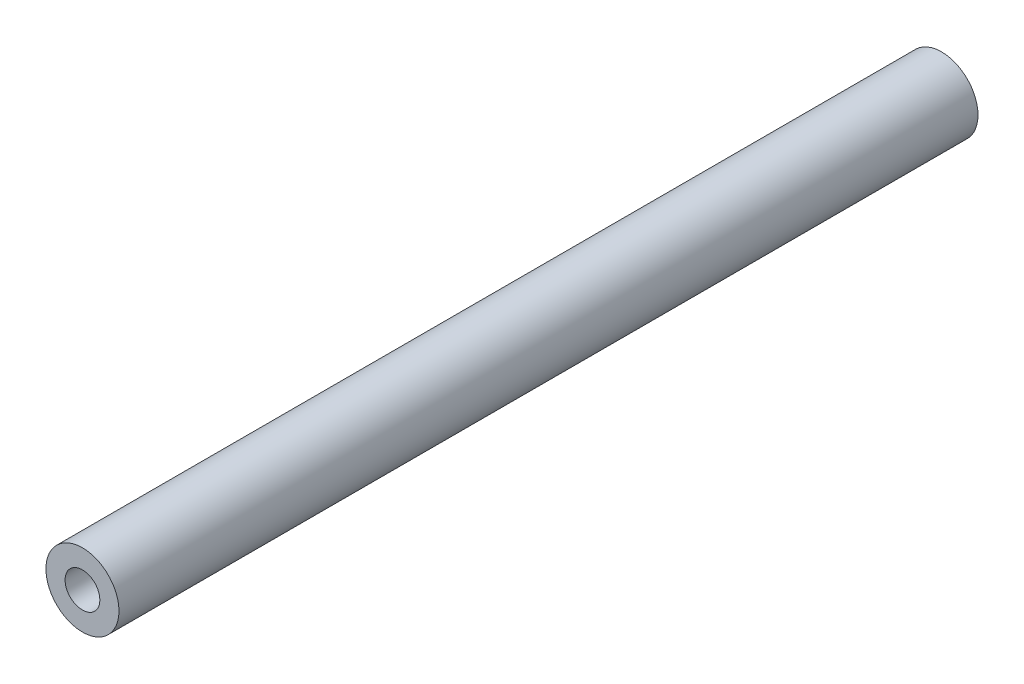
ISO-10303-21;
HEADER;
FILE_DESCRIPTION(('STEP AP214'),'2;1');
FILE_NAME('part.step','',(''),(''),'','','');
FILE_SCHEMA(('AUTOMOTIVE_DESIGN { 1 0 10303 214 1 1 1 1 }'));
ENDSEC;
DATA;
#1=APPLICATION_CONTEXT('core data for automotive mechanical design processes');
#2=APPLICATION_PROTOCOL_DEFINITION('international standard','automotive_design',2000,#1);
#3=PRODUCT_CONTEXT('',#1,'mechanical');
#4=PRODUCT('Part','Part','',(#3));
#5=PRODUCT_RELATED_PRODUCT_CATEGORY('part','',(#4));
#6=PRODUCT_DEFINITION_FORMATION('','',#4);
#7=PRODUCT_DEFINITION_CONTEXT('part definition',#1,'design');
#8=PRODUCT_DEFINITION('design','',#6,#7);
#9=PRODUCT_DEFINITION_SHAPE('','',#8);
#10=(LENGTH_UNIT() NAMED_UNIT(*) SI_UNIT(.MILLI.,.METRE.));
#11=(NAMED_UNIT(*) PLANE_ANGLE_UNIT() SI_UNIT($,.RADIAN.));
#12=(NAMED_UNIT(*) SI_UNIT($,.STERADIAN.) SOLID_ANGLE_UNIT());
#13=UNCERTAINTY_MEASURE_WITH_UNIT(LENGTH_MEASURE(1.E-05),#10,'distance_accuracy_value','');
#14=(GEOMETRIC_REPRESENTATION_CONTEXT(3) GLOBAL_UNCERTAINTY_ASSIGNED_CONTEXT((#13)) GLOBAL_UNIT_ASSIGNED_CONTEXT((#10,
#11,#12)) REPRESENTATION_CONTEXT('',''));
#15=CARTESIAN_POINT('',(0.,0.,0.));
#16=DIRECTION('',(0.,0.,1.));
#17=DIRECTION('',(1.,0.,0.));
#18=AXIS2_PLACEMENT_3D('',#15,#16,#17);
#19=CARTESIAN_POINT('',(0.,0.,49.4));
#20=DIRECTION('',(0.,0.,1.));
#21=DIRECTION('',(1.,0.,0.));
#22=AXIS2_PLACEMENT_3D('',#19,#20,#21);
#23=PLANE('',#22);
#24=CARTESIAN_POINT('',(0.,0.,49.4));
#25=DIRECTION('',(0.,0.,1.));
#26=DIRECTION('',(1.,0.,0.));
#27=AXIS2_PLACEMENT_3D('',#24,#25,#26);
#28=CIRCLE('',#27,2.1);
#29=CARTESIAN_POINT('',(2.1,0.,49.4));
#30=VERTEX_POINT('',#29);
#31=EDGE_CURVE('E10',#30,#30,#28,.T.);
#32=ORIENTED_EDGE('',*,*,#31,.T.);
#33=EDGE_LOOP('',(#32));
#34=FACE_BOUND('',#33,.T.);
#35=CARTESIAN_POINT('',(0.,0.,49.4));
#36=DIRECTION('',(0.,0.,1.));
#37=DIRECTION('',(1.,0.,0.));
#38=AXIS2_PLACEMENT_3D('',#35,#36,#37);
#39=CIRCLE('',#38,1.);
#40=CARTESIAN_POINT('',(1.,0.,49.4));
#41=VERTEX_POINT('',#40);
#42=EDGE_CURVE('E41',#41,#41,#39,.T.);
#43=ORIENTED_EDGE('',*,*,#42,.F.);
#44=EDGE_LOOP('',(#43));
#45=FACE_BOUND('',#44,.T.);
#46=ADVANCED_FACE('F30',(#34,#45),#23,.T.);
#47=CARTESIAN_POINT('',(0.,0.,0.));
#48=DIRECTION('',(0.,0.,1.));
#49=DIRECTION('',(1.,0.,0.));
#50=AXIS2_PLACEMENT_3D('',#47,#48,#49);
#51=PLANE('',#50);
#52=CARTESIAN_POINT('',(0.,0.,0.));
#53=DIRECTION('',(0.,0.,1.));
#54=DIRECTION('',(1.,0.,0.));
#55=AXIS2_PLACEMENT_3D('',#52,#53,#54);
#56=CIRCLE('',#55,2.1);
#57=CARTESIAN_POINT('',(2.1,0.,0.));
#58=VERTEX_POINT('',#57);
#59=EDGE_CURVE('E34',#58,#58,#56,.T.);
#60=ORIENTED_EDGE('',*,*,#59,.F.);
#61=EDGE_LOOP('',(#60));
#62=FACE_BOUND('',#61,.T.);
#63=CARTESIAN_POINT('',(0.,0.,0.));
#64=DIRECTION('',(0.,0.,1.));
#65=DIRECTION('',(1.,0.,0.));
#66=AXIS2_PLACEMENT_3D('',#63,#64,#65);
#67=CIRCLE('',#66,1.);
#68=CARTESIAN_POINT('',(1.,0.,0.));
#69=VERTEX_POINT('',#68);
#70=EDGE_CURVE('E43',#69,#69,#67,.T.);
#71=ORIENTED_EDGE('',*,*,#70,.T.);
#72=EDGE_LOOP('',(#71));
#73=FACE_BOUND('',#72,.T.);
#74=ADVANCED_FACE('F53',(#62,#73),#51,.F.);
#75=CARTESIAN_POINT('',(0.,0.,49.4));
#76=DIRECTION('',(0.,0.,-1.));
#77=DIRECTION('',(-1.,0.,0.));
#78=AXIS2_PLACEMENT_3D('',#75,#76,#77);
#79=CYLINDRICAL_SURFACE('',#78,2.1);
#80=ORIENTED_EDGE('',*,*,#31,.F.);
#81=EDGE_LOOP('',(#80));
#82=FACE_BOUND('',#81,.T.);
#83=ORIENTED_EDGE('',*,*,#59,.T.);
#84=EDGE_LOOP('',(#83));
#85=FACE_BOUND('',#84,.T.);
#86=ADVANCED_FACE('F32',(#82,#85),#79,.T.);
#87=CARTESIAN_POINT('',(0.,0.,49.4));
#88=DIRECTION('',(0.,0.,-1.));
#89=DIRECTION('',(-1.,0.,0.));
#90=AXIS2_PLACEMENT_3D('',#87,#88,#89);
#91=CYLINDRICAL_SURFACE('',#90,1.);
#92=ORIENTED_EDGE('',*,*,#42,.T.);
#93=EDGE_LOOP('',(#92));
#94=FACE_BOUND('',#93,.T.);
#95=ORIENTED_EDGE('',*,*,#70,.F.);
#96=EDGE_LOOP('',(#95));
#97=FACE_BOUND('',#96,.T.);
#98=ADVANCED_FACE('F49',(#94,#97),#91,.F.);
#99=CLOSED_SHELL('',(#46,#74,#86,#98));
#100=MANIFOLD_SOLID_BREP('B2',#99);
#101=ADVANCED_BREP_SHAPE_REPRESENTATION('',(#18,#100),#14);
#102=SHAPE_DEFINITION_REPRESENTATION(#9,#101);
ENDSEC;
END-ISO-10303-21;
